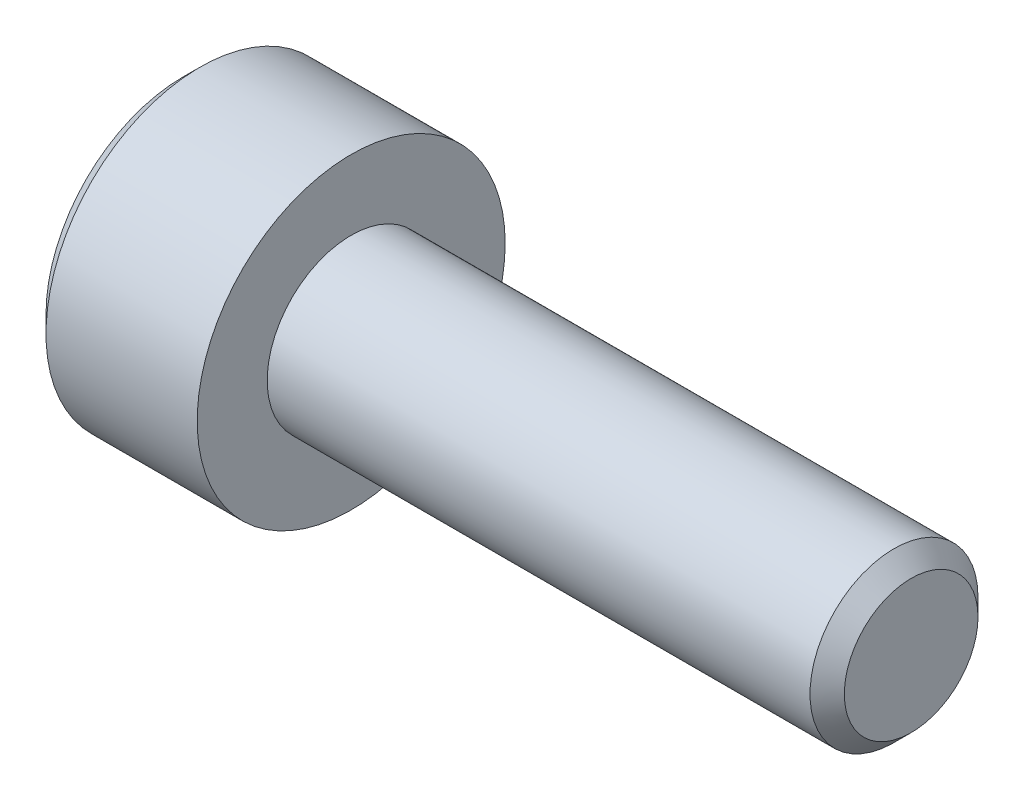
ISO-10303-21;
HEADER;
FILE_DESCRIPTION(('STEP AP214'),'2;1');
FILE_NAME('part.step','',(''),(''),'','','');
FILE_SCHEMA(('AUTOMOTIVE_DESIGN { 1 0 10303 214 1 1 1 1 }'));
ENDSEC;
DATA;
#1=APPLICATION_CONTEXT('core data for automotive mechanical design processes');
#2=APPLICATION_PROTOCOL_DEFINITION('international standard','automotive_design',2000,#1);
#3=PRODUCT_CONTEXT('',#1,'mechanical');
#4=PRODUCT('Part','Part','',(#3));
#5=PRODUCT_RELATED_PRODUCT_CATEGORY('part','',(#4));
#6=PRODUCT_DEFINITION_FORMATION('','',#4);
#7=PRODUCT_DEFINITION_CONTEXT('part definition',#1,'design');
#8=PRODUCT_DEFINITION('design','',#6,#7);
#9=PRODUCT_DEFINITION_SHAPE('','',#8);
#10=(LENGTH_UNIT() NAMED_UNIT(*) SI_UNIT(.MILLI.,.METRE.));
#11=(NAMED_UNIT(*) PLANE_ANGLE_UNIT() SI_UNIT($,.RADIAN.));
#12=(NAMED_UNIT(*) SI_UNIT($,.STERADIAN.) SOLID_ANGLE_UNIT());
#13=UNCERTAINTY_MEASURE_WITH_UNIT(LENGTH_MEASURE(1.E-05),#10,'distance_accuracy_value','');
#14=(GEOMETRIC_REPRESENTATION_CONTEXT(3) GLOBAL_UNCERTAINTY_ASSIGNED_CONTEXT((#13)) GLOBAL_UNIT_ASSIGNED_CONTEXT((#10,
#11,#12)) REPRESENTATION_CONTEXT('',''));
#15=CARTESIAN_POINT('',(0.,0.,0.));
#16=DIRECTION('',(0.,0.,1.));
#17=DIRECTION('',(1.,0.,0.));
#18=AXIS2_PLACEMENT_3D('',#15,#16,#17);
#19=CARTESIAN_POINT('',(-1.5,0.,0.));
#20=DIRECTION('',(-1.,0.,0.));
#21=DIRECTION('',(0.,0.,1.));
#22=AXIS2_PLACEMENT_3D('',#19,#20,#21);
#23=CONICAL_SURFACE('',#22,1.25,1.30899693899575);
#24=CARTESIAN_POINT('',(-1.5,0.,0.));
#25=DIRECTION('',(1.,0.,0.));
#26=DIRECTION('',(0.,0.,-1.));
#27=AXIS2_PLACEMENT_3D('',#24,#25,#26);
#28=CIRCLE('',#27,1.25);
#29=CARTESIAN_POINT('',(-1.5,1.08253175473055,-0.625));
#30=VERTEX_POINT('',#29);
#31=CARTESIAN_POINT('',(-1.5,1.08253175473055,0.625));
#32=VERTEX_POINT('',#31);
#33=EDGE_CURVE('E215',#30,#32,#28,.T.);
#34=ORIENTED_EDGE('',*,*,#33,.F.);
#35=CARTESIAN_POINT('',(-1.5,0.,0.));
#36=DIRECTION('',(1.,0.,0.));
#37=DIRECTION('',(0.,0.,-1.));
#38=AXIS2_PLACEMENT_3D('',#35,#36,#37);
#39=CIRCLE('',#38,1.25);
#40=CARTESIAN_POINT('',(-1.5,0.,-1.25));
#41=VERTEX_POINT('',#40);
#42=EDGE_CURVE('E211',#41,#30,#39,.T.);
#43=ORIENTED_EDGE('',*,*,#42,.F.);
#44=CARTESIAN_POINT('',(-1.5,0.,0.));
#45=DIRECTION('',(1.,0.,0.));
#46=DIRECTION('',(0.,0.,-1.));
#47=AXIS2_PLACEMENT_3D('',#44,#45,#46);
#48=CIRCLE('',#47,1.25);
#49=CARTESIAN_POINT('',(-1.5,-1.08253175473055,-0.625));
#50=VERTEX_POINT('',#49);
#51=EDGE_CURVE('E10',#50,#41,#48,.T.);
#52=ORIENTED_EDGE('',*,*,#51,.F.);
#53=CARTESIAN_POINT('',(-1.5,0.,0.));
#54=DIRECTION('',(1.,0.,0.));
#55=DIRECTION('',(0.,0.,-1.));
#56=AXIS2_PLACEMENT_3D('',#53,#54,#55);
#57=CIRCLE('',#56,1.25);
#58=CARTESIAN_POINT('',(-1.5,-1.08253175473055,0.625));
#59=VERTEX_POINT('',#58);
#60=EDGE_CURVE('E25',#59,#50,#57,.T.);
#61=ORIENTED_EDGE('',*,*,#60,.F.);
#62=CARTESIAN_POINT('',(-1.5,0.,0.));
#63=DIRECTION('',(1.,0.,0.));
#64=DIRECTION('',(0.,0.,-1.));
#65=AXIS2_PLACEMENT_3D('',#62,#63,#64);
#66=CIRCLE('',#65,1.25);
#67=CARTESIAN_POINT('',(-1.5,0.,1.25));
#68=VERTEX_POINT('',#67);
#69=EDGE_CURVE('E220',#68,#59,#66,.T.);
#70=ORIENTED_EDGE('',*,*,#69,.F.);
#71=CARTESIAN_POINT('',(-1.5,0.,0.));
#72=DIRECTION('',(1.,0.,0.));
#73=DIRECTION('',(0.,0.,-1.));
#74=AXIS2_PLACEMENT_3D('',#71,#72,#73);
#75=CIRCLE('',#74,1.25);
#76=EDGE_CURVE('E37',#32,#68,#75,.T.);
#77=ORIENTED_EDGE('',*,*,#76,.F.);
#78=EDGE_LOOP('',(#34,#43,#52,#61,#70,#77));
#79=FACE_BOUND('',#78,.T.);
#80=CARTESIAN_POINT('',(-1.1650635094611,0.,0.));
#81=VERTEX_POINT('',#80);
#82=VERTEX_LOOP('',#81);
#83=FACE_BOUND('',#82,.T.);
#84=ADVANCED_FACE('F16',(#79,#83),#23,.F.);
#85=CARTESIAN_POINT('',(-1.5,0.,0.));
#86=DIRECTION('',(1.,0.,0.));
#87=DIRECTION('',(0.,1.,0.));
#88=AXIS2_PLACEMENT_3D('',#85,#86,#87);
#89=PLANE('',#88);
#90=ORIENTED_EDGE('',*,*,#51,.T.);
#91=DIRECTION('',(0.,1.,0.));
#92=VECTOR('',#91,1.);
#93=CARTESIAN_POINT('',(-1.5,-0.721687836487032,-1.25));
#94=LINE('',#93,#92);
#95=CARTESIAN_POINT('',(-1.5,-0.721687836487032,-1.25));
#96=VERTEX_POINT('',#95);
#97=EDGE_CURVE('E190',#96,#41,#94,.T.);
#98=ORIENTED_EDGE('',*,*,#97,.F.);
#99=DIRECTION('',(0.,0.5,-0.866025403784439));
#100=VECTOR('',#99,1.);
#101=CARTESIAN_POINT('',(-1.5,-1.44337567297406,0.));
#102=LINE('',#101,#100);
#103=EDGE_CURVE('E183',#50,#96,#102,.T.);
#104=ORIENTED_EDGE('',*,*,#103,.F.);
#105=EDGE_LOOP('',(#90,#98,#104));
#106=FACE_BOUND('',#105,.T.);
#107=ADVANCED_FACE('F233',(#106),#89,.F.);
#108=CARTESIAN_POINT('',(-1.5,0.,0.));
#109=DIRECTION('',(1.,0.,0.));
#110=DIRECTION('',(0.,1.,0.));
#111=AXIS2_PLACEMENT_3D('',#108,#109,#110);
#112=PLANE('',#111);
#113=ORIENTED_EDGE('',*,*,#60,.T.);
#114=DIRECTION('',(0.,0.5,-0.866025403784439));
#115=VECTOR('',#114,1.);
#116=CARTESIAN_POINT('',(-1.5,-1.44337567297406,0.));
#117=LINE('',#116,#115);
#118=CARTESIAN_POINT('',(-1.5,-1.44337567297406,0.));
#119=VERTEX_POINT('',#118);
#120=EDGE_CURVE('E179',#119,#50,#117,.T.);
#121=ORIENTED_EDGE('',*,*,#120,.F.);
#122=DIRECTION('',(0.,-0.5,-0.866025403784439));
#123=VECTOR('',#122,1.);
#124=CARTESIAN_POINT('',(-1.5,-0.721687836487032,1.25));
#125=LINE('',#124,#123);
#126=EDGE_CURVE('E166',#59,#119,#125,.T.);
#127=ORIENTED_EDGE('',*,*,#126,.F.);
#128=EDGE_LOOP('',(#113,#121,#127));
#129=FACE_BOUND('',#128,.T.);
#130=ADVANCED_FACE('F230',(#129),#112,.F.);
#131=CARTESIAN_POINT('',(-1.5,0.,0.));
#132=DIRECTION('',(1.,0.,0.));
#133=DIRECTION('',(0.,1.,0.));
#134=AXIS2_PLACEMENT_3D('',#131,#132,#133);
#135=PLANE('',#134);
#136=ORIENTED_EDGE('',*,*,#69,.T.);
#137=DIRECTION('',(0.,-0.5,-0.866025403784439));
#138=VECTOR('',#137,1.);
#139=CARTESIAN_POINT('',(-1.5,-0.721687836487032,1.25));
#140=LINE('',#139,#138);
#141=CARTESIAN_POINT('',(-1.5,-0.721687836487032,1.25));
#142=VERTEX_POINT('',#141);
#143=EDGE_CURVE('E161',#142,#59,#140,.T.);
#144=ORIENTED_EDGE('',*,*,#143,.F.);
#145=DIRECTION('',(0.,-1.,0.));
#146=VECTOR('',#145,1.);
#147=CARTESIAN_POINT('',(-1.5,0.721687836487032,1.25));
#148=LINE('',#147,#146);
#149=EDGE_CURVE('E162',#68,#142,#148,.T.);
#150=ORIENTED_EDGE('',*,*,#149,.F.);
#151=EDGE_LOOP('',(#136,#144,#150));
#152=FACE_BOUND('',#151,.T.);
#153=ADVANCED_FACE('F248',(#152),#135,.F.);
#154=CARTESIAN_POINT('',(-1.5,0.,0.));
#155=DIRECTION('',(1.,0.,0.));
#156=DIRECTION('',(0.,1.,0.));
#157=AXIS2_PLACEMENT_3D('',#154,#155,#156);
#158=PLANE('',#157);
#159=ORIENTED_EDGE('',*,*,#76,.T.);
#160=DIRECTION('',(0.,-1.,0.));
#161=VECTOR('',#160,1.);
#162=CARTESIAN_POINT('',(-1.5,0.721687836487032,1.25));
#163=LINE('',#162,#161);
#164=CARTESIAN_POINT('',(-1.5,0.721687836487032,1.25));
#165=VERTEX_POINT('',#164);
#166=EDGE_CURVE('E149',#165,#68,#163,.T.);
#167=ORIENTED_EDGE('',*,*,#166,.F.);
#168=DIRECTION('',(0.,-0.5,0.866025403784439));
#169=VECTOR('',#168,1.);
#170=CARTESIAN_POINT('',(-1.5,1.44337567297406,0.));
#171=LINE('',#170,#169);
#172=EDGE_CURVE('E171',#32,#165,#171,.T.);
#173=ORIENTED_EDGE('',*,*,#172,.F.);
#174=EDGE_LOOP('',(#159,#167,#173));
#175=FACE_BOUND('',#174,.T.);
#176=ADVANCED_FACE('F254',(#175),#158,.F.);
#177=CARTESIAN_POINT('',(-1.5,0.,0.));
#178=DIRECTION('',(1.,0.,0.));
#179=DIRECTION('',(0.,1.,0.));
#180=AXIS2_PLACEMENT_3D('',#177,#178,#179);
#181=PLANE('',#180);
#182=DIRECTION('',(0.,0.5,0.866025403784439));
#183=VECTOR('',#182,1.);
#184=CARTESIAN_POINT('',(-1.5,0.721687836487032,-1.25));
#185=LINE('',#184,#183);
#186=CARTESIAN_POINT('',(-1.5,1.44337567297406,0.));
#187=VERTEX_POINT('',#186);
#188=EDGE_CURVE('E205',#30,#187,#185,.T.);
#189=ORIENTED_EDGE('',*,*,#188,.F.);
#190=ORIENTED_EDGE('',*,*,#33,.T.);
#191=DIRECTION('',(0.,-0.5,0.866025403784439));
#192=VECTOR('',#191,1.);
#193=CARTESIAN_POINT('',(-1.5,1.44337567297406,0.));
#194=LINE('',#193,#192);
#195=EDGE_CURVE('E167',#187,#32,#194,.T.);
#196=ORIENTED_EDGE('',*,*,#195,.F.);
#197=EDGE_LOOP('',(#189,#190,#196));
#198=FACE_BOUND('',#197,.T.);
#199=ADVANCED_FACE('F262',(#198),#181,.F.);
#200=CARTESIAN_POINT('',(-1.5,0.,0.));
#201=DIRECTION('',(1.,0.,0.));
#202=DIRECTION('',(0.,1.,0.));
#203=AXIS2_PLACEMENT_3D('',#200,#201,#202);
#204=PLANE('',#203);
#205=ORIENTED_EDGE('',*,*,#42,.T.);
#206=DIRECTION('',(0.,0.5,0.866025403784439));
#207=VECTOR('',#206,1.);
#208=CARTESIAN_POINT('',(-1.5,0.721687836487032,-1.25));
#209=LINE('',#208,#207);
#210=CARTESIAN_POINT('',(-1.5,0.721687836487032,-1.25));
#211=VERTEX_POINT('',#210);
#212=EDGE_CURVE('E201',#211,#30,#209,.T.);
#213=ORIENTED_EDGE('',*,*,#212,.F.);
#214=DIRECTION('',(0.,1.,0.));
#215=VECTOR('',#214,1.);
#216=CARTESIAN_POINT('',(-1.5,-0.721687836487032,-1.25));
#217=LINE('',#216,#215);
#218=EDGE_CURVE('E194',#41,#211,#217,.T.);
#219=ORIENTED_EDGE('',*,*,#218,.F.);
#220=EDGE_LOOP('',(#205,#213,#219));
#221=FACE_BOUND('',#220,.T.);
#222=ADVANCED_FACE('F265',(#221),#204,.F.);
#223=CARTESIAN_POINT('',(-1.5,1.44337567297406,0.));
#224=DIRECTION('',(0.,-0.866025403784439,-0.5));
#225=DIRECTION('',(0.,0.5,-0.866025403784439));
#226=AXIS2_PLACEMENT_3D('',#223,#224,#225);
#227=PLANE('',#226);
#228=DIRECTION('',(0.,-0.5,0.866025403784439));
#229=VECTOR('',#228,1.);
#230=CARTESIAN_POINT('',(-3.,1.44337567297406,0.));
#231=LINE('',#230,#229);
#232=CARTESIAN_POINT('',(-3.,1.44337567297406,0.));
#233=VERTEX_POINT('',#232);
#234=CARTESIAN_POINT('',(-3.,0.721687836487032,1.25));
#235=VERTEX_POINT('',#234);
#236=EDGE_CURVE('E296',#233,#235,#231,.T.);
#237=ORIENTED_EDGE('',*,*,#236,.F.);
#238=DIRECTION('',(-1.,0.,0.));
#239=VECTOR('',#238,1.);
#240=CARTESIAN_POINT('',(-1.5,1.44337567297406,0.));
#241=LINE('',#240,#239);
#242=EDGE_CURVE('E172',#187,#233,#241,.T.);
#243=ORIENTED_EDGE('',*,*,#242,.F.);
#244=ORIENTED_EDGE('',*,*,#195,.T.);
#245=ORIENTED_EDGE('',*,*,#172,.T.);
#246=DIRECTION('',(-1.,0.,0.));
#247=VECTOR('',#246,1.);
#248=CARTESIAN_POINT('',(-1.5,0.721687836487032,1.25));
#249=LINE('',#248,#247);
#250=EDGE_CURVE('E151',#165,#235,#249,.T.);
#251=ORIENTED_EDGE('',*,*,#250,.T.);
#252=EDGE_LOOP('',(#237,#243,#244,#245,#251));
#253=FACE_BOUND('',#252,.T.);
#254=ADVANCED_FACE('F259',(#253),#227,.T.);
#255=CARTESIAN_POINT('',(-1.5,0.721687836487032,-1.25));
#256=DIRECTION('',(0.,-0.866025403784439,0.5));
#257=DIRECTION('',(-1.,0.,0.));
#258=AXIS2_PLACEMENT_3D('',#255,#256,#257);
#259=PLANE('',#258);
#260=DIRECTION('',(0.,0.5,0.866025403784439));
#261=VECTOR('',#260,1.);
#262=CARTESIAN_POINT('',(-3.,0.721687836487032,-1.25));
#263=LINE('',#262,#261);
#264=CARTESIAN_POINT('',(-3.,0.721687836487032,-1.25));
#265=VERTEX_POINT('',#264);
#266=EDGE_CURVE('E276',#265,#233,#263,.T.);
#267=ORIENTED_EDGE('',*,*,#266,.F.);
#268=DIRECTION('',(-1.,0.,0.));
#269=VECTOR('',#268,1.);
#270=CARTESIAN_POINT('',(-1.5,0.721687836487032,-1.25));
#271=LINE('',#270,#269);
#272=EDGE_CURVE('E198',#211,#265,#271,.T.);
#273=ORIENTED_EDGE('',*,*,#272,.F.);
#274=ORIENTED_EDGE('',*,*,#212,.T.);
#275=ORIENTED_EDGE('',*,*,#188,.T.);
#276=ORIENTED_EDGE('',*,*,#242,.T.);
#277=EDGE_LOOP('',(#267,#273,#274,#275,#276));
#278=FACE_BOUND('',#277,.T.);
#279=ADVANCED_FACE('F378',(#278),#259,.T.);
#280=CARTESIAN_POINT('',(-1.5,-0.721687836487032,-1.25));
#281=DIRECTION('',(0.,0.,1.));
#282=DIRECTION('',(1.,0.,0.));
#283=AXIS2_PLACEMENT_3D('',#280,#281,#282);
#284=PLANE('',#283);
#285=DIRECTION('',(0.,1.,0.));
#286=VECTOR('',#285,1.);
#287=CARTESIAN_POINT('',(-3.,-0.721687836487032,-1.25));
#288=LINE('',#287,#286);
#289=CARTESIAN_POINT('',(-3.,-0.721687836487032,-1.25));
#290=VERTEX_POINT('',#289);
#291=EDGE_CURVE('E271',#290,#265,#288,.T.);
#292=ORIENTED_EDGE('',*,*,#291,.F.);
#293=DIRECTION('',(-1.,0.,0.));
#294=VECTOR('',#293,1.);
#295=CARTESIAN_POINT('',(-1.5,-0.721687836487032,-1.25));
#296=LINE('',#295,#294);
#297=EDGE_CURVE('E187',#96,#290,#296,.T.);
#298=ORIENTED_EDGE('',*,*,#297,.F.);
#299=ORIENTED_EDGE('',*,*,#97,.T.);
#300=ORIENTED_EDGE('',*,*,#218,.T.);
#301=ORIENTED_EDGE('',*,*,#272,.T.);
#302=EDGE_LOOP('',(#292,#298,#299,#300,#301));
#303=FACE_BOUND('',#302,.T.);
#304=ADVANCED_FACE('F269',(#303),#284,.T.);
#305=CARTESIAN_POINT('',(-1.5,-1.44337567297406,0.));
#306=DIRECTION('',(0.,0.866025403784439,0.5));
#307=DIRECTION('',(1.,0.,0.));
#308=AXIS2_PLACEMENT_3D('',#305,#306,#307);
#309=PLANE('',#308);
#310=DIRECTION('',(0.,0.5,-0.866025403784439));
#311=VECTOR('',#310,1.);
#312=CARTESIAN_POINT('',(-3.,-1.44337567297406,0.));
#313=LINE('',#312,#311);
#314=CARTESIAN_POINT('',(-3.,-1.44337567297406,0.));
#315=VERTEX_POINT('',#314);
#316=EDGE_CURVE('E240',#315,#290,#313,.T.);
#317=ORIENTED_EDGE('',*,*,#316,.F.);
#318=DIRECTION('',(-1.,0.,0.));
#319=VECTOR('',#318,1.);
#320=CARTESIAN_POINT('',(-1.5,-1.44337567297406,0.));
#321=LINE('',#320,#319);
#322=EDGE_CURVE('E176',#119,#315,#321,.T.);
#323=ORIENTED_EDGE('',*,*,#322,.F.);
#324=ORIENTED_EDGE('',*,*,#120,.T.);
#325=ORIENTED_EDGE('',*,*,#103,.T.);
#326=ORIENTED_EDGE('',*,*,#297,.T.);
#327=EDGE_LOOP('',(#317,#323,#324,#325,#326));
#328=FACE_BOUND('',#327,.T.);
#329=ADVANCED_FACE('F238',(#328),#309,.T.);
#330=CARTESIAN_POINT('',(-1.5,-0.721687836487032,1.25));
#331=DIRECTION('',(0.,0.866025403784439,-0.5));
#332=DIRECTION('',(-1.,0.,0.));
#333=AXIS2_PLACEMENT_3D('',#330,#331,#332);
#334=PLANE('',#333);
#335=DIRECTION('',(0.,-0.5,-0.866025403784439));
#336=VECTOR('',#335,1.);
#337=CARTESIAN_POINT('',(-3.,-0.721687836487032,1.25));
#338=LINE('',#337,#336);
#339=CARTESIAN_POINT('',(-3.,-0.721687836487032,1.25));
#340=VERTEX_POINT('',#339);
#341=EDGE_CURVE('E136',#340,#315,#338,.T.);
#342=ORIENTED_EDGE('',*,*,#341,.F.);
#343=DIRECTION('',(-1.,0.,0.));
#344=VECTOR('',#343,1.);
#345=CARTESIAN_POINT('',(-1.5,-0.721687836487032,1.25));
#346=LINE('',#345,#344);
#347=EDGE_CURVE('E158',#142,#340,#346,.T.);
#348=ORIENTED_EDGE('',*,*,#347,.F.);
#349=ORIENTED_EDGE('',*,*,#143,.T.);
#350=ORIENTED_EDGE('',*,*,#126,.T.);
#351=ORIENTED_EDGE('',*,*,#322,.T.);
#352=EDGE_LOOP('',(#342,#348,#349,#350,#351));
#353=FACE_BOUND('',#352,.T.);
#354=ADVANCED_FACE('F243',(#353),#334,.T.);
#355=CARTESIAN_POINT('',(-1.5,0.721687836487032,1.25));
#356=DIRECTION('',(0.,0.,-1.));
#357=DIRECTION('',(0.,-1.,0.));
#358=AXIS2_PLACEMENT_3D('',#355,#356,#357);
#359=PLANE('',#358);
#360=DIRECTION('',(0.,-1.,0.));
#361=VECTOR('',#360,1.);
#362=CARTESIAN_POINT('',(-3.,0.721687836487032,1.25));
#363=LINE('',#362,#361);
#364=EDGE_CURVE('E146',#235,#340,#363,.T.);
#365=ORIENTED_EDGE('',*,*,#364,.F.);
#366=ORIENTED_EDGE('',*,*,#250,.F.);
#367=ORIENTED_EDGE('',*,*,#166,.T.);
#368=ORIENTED_EDGE('',*,*,#149,.T.);
#369=ORIENTED_EDGE('',*,*,#347,.T.);
#370=EDGE_LOOP('',(#365,#366,#367,#368,#369));
#371=FACE_BOUND('',#370,.T.);
#372=ADVANCED_FACE('F305',(#371),#359,.T.);
#373=CARTESIAN_POINT('',(10.,1.1935,0.));
#374=DIRECTION('',(-1.,0.,0.));
#375=DIRECTION('',(0.,0.,1.));
#376=AXIS2_PLACEMENT_3D('',#373,#374,#375);
#377=PLANE('',#376);
#378=CARTESIAN_POINT('',(10.,0.,0.));
#379=DIRECTION('',(1.,0.,0.));
#380=DIRECTION('',(0.,0.,-1.));
#381=AXIS2_PLACEMENT_3D('',#378,#379,#380);
#382=CIRCLE('',#381,1.1935);
#383=CARTESIAN_POINT('',(10.,0.,-1.1935));
#384=VERTEX_POINT('',#383);
#385=EDGE_CURVE('E154',#384,#384,#382,.T.);
#386=ORIENTED_EDGE('',*,*,#385,.T.);
#387=EDGE_LOOP('',(#386));
#388=FACE_BOUND('',#387,.T.);
#389=ADVANCED_FACE('F389',(#388),#377,.F.);
#390=CARTESIAN_POINT('',(9.6935,0.,0.));
#391=DIRECTION('',(-1.,0.,0.));
#392=DIRECTION('',(0.,0.,1.));
#393=AXIS2_PLACEMENT_3D('',#390,#391,#392);
#394=CONICAL_SURFACE('',#393,1.5,0.785398163397449);
#395=CARTESIAN_POINT('',(9.6935,0.,0.));
#396=DIRECTION('',(1.,0.,0.));
#397=DIRECTION('',(0.,0.,-1.));
#398=AXIS2_PLACEMENT_3D('',#395,#396,#397);
#399=CIRCLE('',#398,1.5);
#400=CARTESIAN_POINT('',(9.6935,0.,-1.5));
#401=VERTEX_POINT('',#400);
#402=EDGE_CURVE('E157',#401,#401,#399,.T.);
#403=ORIENTED_EDGE('',*,*,#402,.T.);
#404=EDGE_LOOP('',(#403));
#405=FACE_BOUND('',#404,.T.);
#406=ORIENTED_EDGE('',*,*,#385,.F.);
#407=EDGE_LOOP('',(#406));
#408=FACE_BOUND('',#407,.T.);
#409=ADVANCED_FACE('F358',(#405,#408),#394,.T.);
#410=CARTESIAN_POINT('',(10.,0.,0.));
#411=DIRECTION('',(1.,0.,0.));
#412=DIRECTION('',(0.,0.,-1.));
#413=AXIS2_PLACEMENT_3D('',#410,#411,#412);
#414=CYLINDRICAL_SURFACE('',#413,1.5);
#415=CARTESIAN_POINT('',(0.,0.,0.));
#416=DIRECTION('',(1.,0.,0.));
#417=DIRECTION('',(0.,0.,-1.));
#418=AXIS2_PLACEMENT_3D('',#415,#416,#417);
#419=CIRCLE('',#418,1.5);
#420=CARTESIAN_POINT('',(0.,0.,-1.5));
#421=VERTEX_POINT('',#420);
#422=EDGE_CURVE('E143',#421,#421,#419,.T.);
#423=ORIENTED_EDGE('',*,*,#422,.T.);
#424=EDGE_LOOP('',(#423));
#425=FACE_BOUND('',#424,.T.);
#426=ORIENTED_EDGE('',*,*,#402,.F.);
#427=EDGE_LOOP('',(#426));
#428=FACE_BOUND('',#427,.T.);
#429=ADVANCED_FACE('F344',(#425,#428),#414,.T.);
#430=CARTESIAN_POINT('',(0.,2.75,0.));
#431=DIRECTION('',(-1.,0.,0.));
#432=DIRECTION('',(0.,0.,1.));
#433=AXIS2_PLACEMENT_3D('',#430,#431,#432);
#434=PLANE('',#433);
#435=CARTESIAN_POINT('',(0.,0.,0.));
#436=DIRECTION('',(1.,0.,0.));
#437=DIRECTION('',(0.,0.,-1.));
#438=AXIS2_PLACEMENT_3D('',#435,#436,#437);
#439=CIRCLE('',#438,2.75);
#440=CARTESIAN_POINT('',(0.,0.,-2.75));
#441=VERTEX_POINT('',#440);
#442=EDGE_CURVE('E135',#441,#441,#439,.T.);
#443=ORIENTED_EDGE('',*,*,#442,.T.);
#444=EDGE_LOOP('',(#443));
#445=FACE_BOUND('',#444,.T.);
#446=ORIENTED_EDGE('',*,*,#422,.F.);
#447=EDGE_LOOP('',(#446));
#448=FACE_BOUND('',#447,.T.);
#449=ADVANCED_FACE('F347',(#445,#448),#434,.F.);
#450=CARTESIAN_POINT('',(10.,0.,0.));
#451=DIRECTION('',(1.,0.,0.));
#452=DIRECTION('',(0.,0.,-1.));
#453=AXIS2_PLACEMENT_3D('',#450,#451,#452);
#454=CYLINDRICAL_SURFACE('',#453,2.75);
#455=CARTESIAN_POINT('',(-2.7,0.,0.));
#456=DIRECTION('',(1.,0.,0.));
#457=DIRECTION('',(0.,0.,-1.));
#458=AXIS2_PLACEMENT_3D('',#455,#456,#457);
#459=CIRCLE('',#458,2.75);
#460=CARTESIAN_POINT('',(-2.7,0.,-2.75));
#461=VERTEX_POINT('',#460);
#462=EDGE_CURVE('E130',#461,#461,#459,.T.);
#463=ORIENTED_EDGE('',*,*,#462,.T.);
#464=EDGE_LOOP('',(#463));
#465=FACE_BOUND('',#464,.T.);
#466=ORIENTED_EDGE('',*,*,#442,.F.);
#467=EDGE_LOOP('',(#466));
#468=FACE_BOUND('',#467,.T.);
#469=ADVANCED_FACE('F131',(#465,#468),#454,.T.);
#470=CARTESIAN_POINT('',(-3.,0.,0.));
#471=DIRECTION('',(1.,0.,0.));
#472=DIRECTION('',(0.,0.,-1.));
#473=AXIS2_PLACEMENT_3D('',#470,#471,#472);
#474=CONICAL_SURFACE('',#473,2.45,0.785398163397445);
#475=CARTESIAN_POINT('',(-3.,0.,0.));
#476=DIRECTION('',(1.,0.,0.));
#477=DIRECTION('',(0.,0.,-1.));
#478=AXIS2_PLACEMENT_3D('',#475,#476,#477);
#479=CIRCLE('',#478,2.45);
#480=CARTESIAN_POINT('',(-3.,0.,-2.45));
#481=VERTEX_POINT('',#480);
#482=EDGE_CURVE('E282',#481,#481,#479,.T.);
#483=ORIENTED_EDGE('',*,*,#482,.T.);
#484=EDGE_LOOP('',(#483));
#485=FACE_BOUND('',#484,.T.);
#486=ORIENTED_EDGE('',*,*,#462,.F.);
#487=EDGE_LOOP('',(#486));
#488=FACE_BOUND('',#487,.T.);
#489=ADVANCED_FACE('F356',(#485,#488),#474,.T.);
#490=CARTESIAN_POINT('',(-3.,0.,0.));
#491=DIRECTION('',(1.,0.,0.));
#492=DIRECTION('',(0.,1.,0.));
#493=AXIS2_PLACEMENT_3D('',#490,#491,#492);
#494=PLANE('',#493);
#495=ORIENTED_EDGE('',*,*,#316,.T.);
#496=ORIENTED_EDGE('',*,*,#291,.T.);
#497=ORIENTED_EDGE('',*,*,#266,.T.);
#498=ORIENTED_EDGE('',*,*,#236,.T.);
#499=ORIENTED_EDGE('',*,*,#364,.T.);
#500=ORIENTED_EDGE('',*,*,#341,.T.);
#501=EDGE_LOOP('',(#495,#496,#497,#498,#499,#500));
#502=FACE_BOUND('',#501,.T.);
#503=ORIENTED_EDGE('',*,*,#482,.F.);
#504=EDGE_LOOP('',(#503));
#505=FACE_BOUND('',#504,.T.);
#506=ADVANCED_FACE('F278',(#502,#505),#494,.F.);
#507=CLOSED_SHELL('',(#84,#107,#130,#153,#176,#199,#222,#254,#279,#304,#329,#354,#372,#389,#409,
#429,#449,#469,#489,#506));
#508=MANIFOLD_SOLID_BREP('B1',#507);
#509=ADVANCED_BREP_SHAPE_REPRESENTATION('',(#18,#508),#14);
#510=SHAPE_DEFINITION_REPRESENTATION(#9,#509);
ENDSEC;
END-ISO-10303-21;
